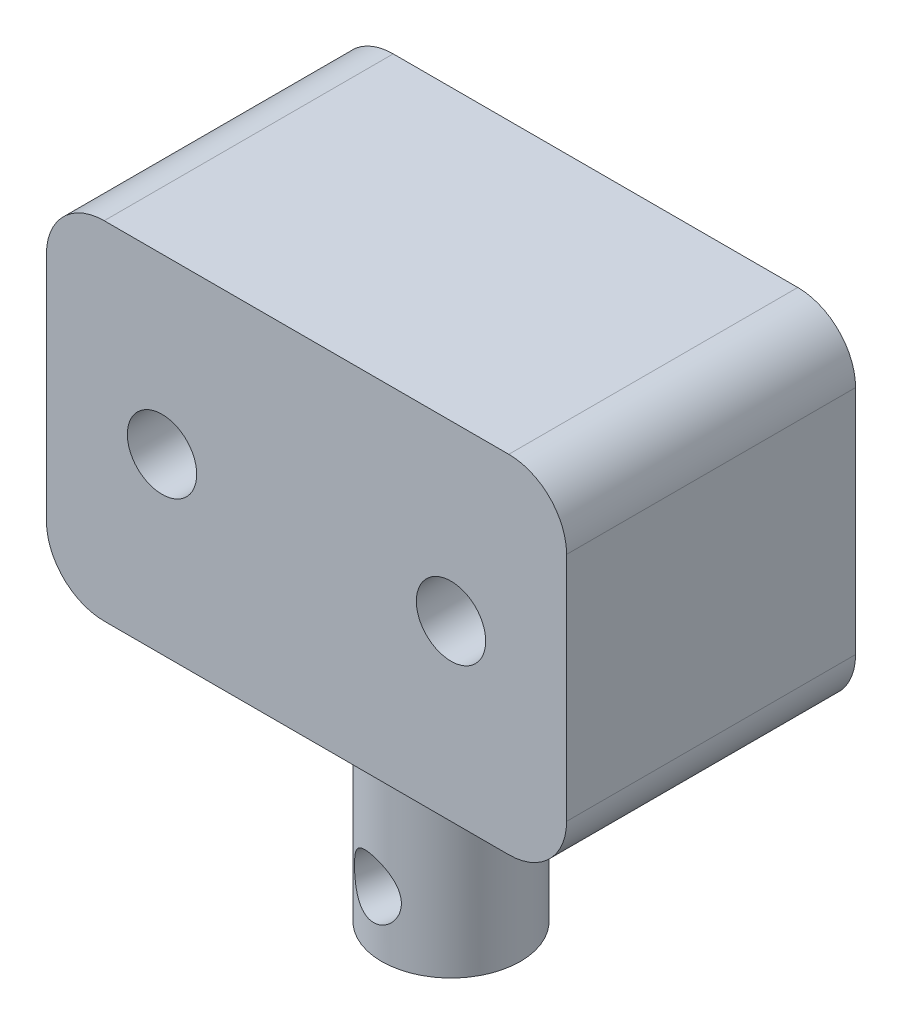
ISO-10303-21;
HEADER;
FILE_DESCRIPTION(('STEP AP214'),'2;1');
FILE_NAME('part.step','',(''),(''),'','','');
FILE_SCHEMA(('AUTOMOTIVE_DESIGN { 1 0 10303 214 1 1 1 1 }'));
ENDSEC;
DATA;
#1=APPLICATION_CONTEXT('core data for automotive mechanical design processes');
#2=APPLICATION_PROTOCOL_DEFINITION('international standard','automotive_design',2000,#1);
#3=PRODUCT_CONTEXT('',#1,'mechanical');
#4=PRODUCT('Part','Part','',(#3));
#5=PRODUCT_RELATED_PRODUCT_CATEGORY('part','',(#4));
#6=PRODUCT_DEFINITION_FORMATION('','',#4);
#7=PRODUCT_DEFINITION_CONTEXT('part definition',#1,'design');
#8=PRODUCT_DEFINITION('design','',#6,#7);
#9=PRODUCT_DEFINITION_SHAPE('','',#8);
#10=(LENGTH_UNIT() NAMED_UNIT(*) SI_UNIT(.MILLI.,.METRE.));
#11=(NAMED_UNIT(*) PLANE_ANGLE_UNIT() SI_UNIT($,.RADIAN.));
#12=(NAMED_UNIT(*) SI_UNIT($,.STERADIAN.) SOLID_ANGLE_UNIT());
#13=UNCERTAINTY_MEASURE_WITH_UNIT(LENGTH_MEASURE(1.E-05),#10,'distance_accuracy_value','');
#14=(GEOMETRIC_REPRESENTATION_CONTEXT(3) GLOBAL_UNCERTAINTY_ASSIGNED_CONTEXT((#13)) GLOBAL_UNIT_ASSIGNED_CONTEXT((#10,
#11,#12)) REPRESENTATION_CONTEXT('',''));
#15=CARTESIAN_POINT('',(0.,0.,0.));
#16=DIRECTION('',(0.,0.,1.));
#17=DIRECTION('',(1.,0.,0.));
#18=AXIS2_PLACEMENT_3D('',#15,#16,#17);
#19=CARTESIAN_POINT('',(-22.5,-15.,25.));
#20=DIRECTION('',(0.,1.,0.));
#21=DIRECTION('',(0.,0.,1.));
#22=AXIS2_PLACEMENT_3D('',#19,#20,#21);
#23=PLANE('',#22);
#24=DIRECTION('',(1.,0.,0.));
#25=VECTOR('',#24,1.);
#26=CARTESIAN_POINT('',(-22.5,-15.,0.));
#27=LINE('',#26,#25);
#28=CARTESIAN_POINT('',(-17.5,-15.,0.));
#29=VERTEX_POINT('',#28);
#30=CARTESIAN_POINT('',(17.5,-15.,0.));
#31=VERTEX_POINT('',#30);
#32=EDGE_CURVE('E139',#29,#31,#27,.T.);
#33=ORIENTED_EDGE('',*,*,#32,.T.);
#34=DIRECTION('',(0.,0.,-1.));
#35=VECTOR('',#34,1.);
#36=CARTESIAN_POINT('',(17.5,-15.,25.));
#37=LINE('',#36,#35);
#38=CARTESIAN_POINT('',(17.5,-15.,25.));
#39=VERTEX_POINT('',#38);
#40=EDGE_CURVE('E56',#31,#39,#37,.F.);
#41=ORIENTED_EDGE('',*,*,#40,.T.);
#42=DIRECTION('',(1.,0.,0.));
#43=VECTOR('',#42,1.);
#44=CARTESIAN_POINT('',(-22.5,-15.,25.));
#45=LINE('',#44,#43);
#46=CARTESIAN_POINT('',(-17.5,-15.,25.));
#47=VERTEX_POINT('',#46);
#48=EDGE_CURVE('E147',#47,#39,#45,.T.);
#49=ORIENTED_EDGE('',*,*,#48,.F.);
#50=DIRECTION('',(0.,0.,-1.));
#51=VECTOR('',#50,1.);
#52=CARTESIAN_POINT('',(-17.5,-15.,25.));
#53=LINE('',#52,#51);
#54=EDGE_CURVE('E163',#47,#29,#53,.T.);
#55=ORIENTED_EDGE('',*,*,#54,.T.);
#56=EDGE_LOOP('',(#33,#41,#49,#55));
#57=FACE_BOUND('',#56,.T.);
#58=CARTESIAN_POINT('',(0.,-15.,12.5));
#59=DIRECTION('',(0.,1.,0.));
#60=DIRECTION('',(0.,0.,1.));
#61=AXIS2_PLACEMENT_3D('',#58,#59,#60);
#62=CIRCLE('',#61,6.);
#63=CARTESIAN_POINT('',(0.,-15.,18.5));
#64=VERTEX_POINT('',#63);
#65=EDGE_CURVE('E11',#64,#64,#62,.F.);
#66=ORIENTED_EDGE('',*,*,#65,.F.);
#67=EDGE_LOOP('',(#66));
#68=FACE_BOUND('',#67,.T.);
#69=ADVANCED_FACE('F35',(#57,#68),#23,.F.);
#70=CARTESIAN_POINT('',(0.,0.,25.));
#71=DIRECTION('',(0.,0.,-1.));
#72=DIRECTION('',(-1.,0.,0.));
#73=AXIS2_PLACEMENT_3D('',#70,#71,#72);
#74=PLANE('',#73);
#75=CARTESIAN_POINT('',(-12.5,0.,25.));
#76=DIRECTION('',(0.,0.,1.));
#77=DIRECTION('',(1.,0.,0.));
#78=AXIS2_PLACEMENT_3D('',#75,#76,#77);
#79=CIRCLE('',#78,3.);
#80=CARTESIAN_POINT('',(-9.5,0.,25.));
#81=VERTEX_POINT('',#80);
#82=EDGE_CURVE('E141',#81,#81,#79,.T.);
#83=ORIENTED_EDGE('',*,*,#82,.F.);
#84=EDGE_LOOP('',(#83));
#85=FACE_BOUND('',#84,.T.);
#86=DIRECTION('',(0.,1.,0.));
#87=VECTOR('',#86,1.);
#88=CARTESIAN_POINT('',(22.5,-15.,25.));
#89=LINE('',#88,#87);
#90=CARTESIAN_POINT('',(22.5,-10.,25.));
#91=VERTEX_POINT('',#90);
#92=CARTESIAN_POINT('',(22.5,10.,25.));
#93=VERTEX_POINT('',#92);
#94=EDGE_CURVE('E146',#91,#93,#89,.T.);
#95=ORIENTED_EDGE('',*,*,#94,.T.);
#96=CARTESIAN_POINT('',(17.5,10.,25.));
#97=DIRECTION('',(0.,0.,-1.));
#98=DIRECTION('',(-1.,0.,0.));
#99=AXIS2_PLACEMENT_3D('',#96,#97,#98);
#100=CIRCLE('',#99,5.);
#101=CARTESIAN_POINT('',(17.5,15.,25.));
#102=VERTEX_POINT('',#101);
#103=EDGE_CURVE('E161',#93,#102,#100,.F.);
#104=ORIENTED_EDGE('',*,*,#103,.T.);
#105=DIRECTION('',(-1.,0.,0.));
#106=VECTOR('',#105,1.);
#107=CARTESIAN_POINT('',(-22.5,15.,25.));
#108=LINE('',#107,#106);
#109=CARTESIAN_POINT('',(-17.5,15.,25.));
#110=VERTEX_POINT('',#109);
#111=EDGE_CURVE('E128',#102,#110,#108,.T.);
#112=ORIENTED_EDGE('',*,*,#111,.T.);
#113=CARTESIAN_POINT('',(-17.5,10.,25.));
#114=DIRECTION('',(0.,0.,-1.));
#115=DIRECTION('',(-1.,0.,0.));
#116=AXIS2_PLACEMENT_3D('',#113,#114,#115);
#117=CIRCLE('',#116,5.);
#118=CARTESIAN_POINT('',(-22.5,10.,25.));
#119=VERTEX_POINT('',#118);
#120=EDGE_CURVE('E156',#110,#119,#117,.F.);
#121=ORIENTED_EDGE('',*,*,#120,.T.);
#122=DIRECTION('',(0.,-1.,0.));
#123=VECTOR('',#122,1.);
#124=CARTESIAN_POINT('',(-22.5,-15.,25.));
#125=LINE('',#124,#123);
#126=CARTESIAN_POINT('',(-22.5,-10.,25.));
#127=VERTEX_POINT('',#126);
#128=EDGE_CURVE('E234',#119,#127,#125,.T.);
#129=ORIENTED_EDGE('',*,*,#128,.T.);
#130=CARTESIAN_POINT('',(-17.5,-10.,25.));
#131=DIRECTION('',(0.,0.,-1.));
#132=DIRECTION('',(-1.,0.,0.));
#133=AXIS2_PLACEMENT_3D('',#130,#131,#132);
#134=CIRCLE('',#133,5.);
#135=EDGE_CURVE('E63',#127,#47,#134,.F.);
#136=ORIENTED_EDGE('',*,*,#135,.T.);
#137=ORIENTED_EDGE('',*,*,#48,.T.);
#138=CARTESIAN_POINT('',(17.5,-10.,25.));
#139=DIRECTION('',(0.,0.,-1.));
#140=DIRECTION('',(-1.,0.,0.));
#141=AXIS2_PLACEMENT_3D('',#138,#139,#140);
#142=CIRCLE('',#141,5.);
#143=EDGE_CURVE('E159',#39,#91,#142,.F.);
#144=ORIENTED_EDGE('',*,*,#143,.T.);
#145=EDGE_LOOP('',(#95,#104,#112,#121,#129,#136,#137,#144));
#146=FACE_BOUND('',#145,.T.);
#147=CARTESIAN_POINT('',(12.5,0.,25.));
#148=DIRECTION('',(0.,0.,1.));
#149=DIRECTION('',(-1.,0.,0.));
#150=AXIS2_PLACEMENT_3D('',#147,#148,#149);
#151=CIRCLE('',#150,3.);
#152=CARTESIAN_POINT('',(9.5,0.,25.));
#153=VERTEX_POINT('',#152);
#154=EDGE_CURVE('E243',#153,#153,#151,.T.);
#155=ORIENTED_EDGE('',*,*,#154,.F.);
#156=EDGE_LOOP('',(#155));
#157=FACE_BOUND('',#156,.T.);
#158=ADVANCED_FACE('F192',(#85,#146,#157),#74,.F.);
#159=CARTESIAN_POINT('',(0.,0.,0.));
#160=DIRECTION('',(0.,0.,-1.));
#161=DIRECTION('',(-1.,0.,0.));
#162=AXIS2_PLACEMENT_3D('',#159,#160,#161);
#163=PLANE('',#162);
#164=CARTESIAN_POINT('',(-12.5,0.,0.));
#165=DIRECTION('',(0.,0.,1.));
#166=DIRECTION('',(1.,0.,0.));
#167=AXIS2_PLACEMENT_3D('',#164,#165,#166);
#168=CIRCLE('',#167,3.);
#169=CARTESIAN_POINT('',(-9.5,0.,0.));
#170=VERTEX_POINT('',#169);
#171=EDGE_CURVE('E237',#170,#170,#168,.T.);
#172=ORIENTED_EDGE('',*,*,#171,.T.);
#173=EDGE_LOOP('',(#172));
#174=FACE_BOUND('',#173,.T.);
#175=DIRECTION('',(-1.,0.,0.));
#176=VECTOR('',#175,1.);
#177=CARTESIAN_POINT('',(-22.5,15.,0.));
#178=LINE('',#177,#176);
#179=CARTESIAN_POINT('',(17.5,15.,0.));
#180=VERTEX_POINT('',#179);
#181=CARTESIAN_POINT('',(-17.5,15.,0.));
#182=VERTEX_POINT('',#181);
#183=EDGE_CURVE('E125',#180,#182,#178,.T.);
#184=ORIENTED_EDGE('',*,*,#183,.F.);
#185=CARTESIAN_POINT('',(17.5,10.,0.));
#186=DIRECTION('',(0.,0.,-1.));
#187=DIRECTION('',(-1.,0.,0.));
#188=AXIS2_PLACEMENT_3D('',#185,#186,#187);
#189=CIRCLE('',#188,5.);
#190=CARTESIAN_POINT('',(22.5,10.,0.));
#191=VERTEX_POINT('',#190);
#192=EDGE_CURVE('E108',#180,#191,#189,.T.);
#193=ORIENTED_EDGE('',*,*,#192,.T.);
#194=DIRECTION('',(0.,1.,0.));
#195=VECTOR('',#194,1.);
#196=CARTESIAN_POINT('',(22.5,-15.,0.));
#197=LINE('',#196,#195);
#198=CARTESIAN_POINT('',(22.5,-10.,0.));
#199=VERTEX_POINT('',#198);
#200=EDGE_CURVE('E136',#199,#191,#197,.T.);
#201=ORIENTED_EDGE('',*,*,#200,.F.);
#202=CARTESIAN_POINT('',(17.5,-10.,0.));
#203=DIRECTION('',(0.,0.,-1.));
#204=DIRECTION('',(-1.,0.,0.));
#205=AXIS2_PLACEMENT_3D('',#202,#203,#204);
#206=CIRCLE('',#205,5.);
#207=EDGE_CURVE('E119',#199,#31,#206,.T.);
#208=ORIENTED_EDGE('',*,*,#207,.T.);
#209=ORIENTED_EDGE('',*,*,#32,.F.);
#210=CARTESIAN_POINT('',(-17.5,-10.,0.));
#211=DIRECTION('',(0.,0.,-1.));
#212=DIRECTION('',(-1.,0.,0.));
#213=AXIS2_PLACEMENT_3D('',#210,#211,#212);
#214=CIRCLE('',#213,5.);
#215=CARTESIAN_POINT('',(-22.5,-10.,0.));
#216=VERTEX_POINT('',#215);
#217=EDGE_CURVE('E150',#29,#216,#214,.T.);
#218=ORIENTED_EDGE('',*,*,#217,.T.);
#219=DIRECTION('',(0.,-1.,0.));
#220=VECTOR('',#219,1.);
#221=CARTESIAN_POINT('',(-22.5,-15.,0.));
#222=LINE('',#221,#220);
#223=CARTESIAN_POINT('',(-22.5,10.,0.));
#224=VERTEX_POINT('',#223);
#225=EDGE_CURVE('E135',#224,#216,#222,.T.);
#226=ORIENTED_EDGE('',*,*,#225,.F.);
#227=CARTESIAN_POINT('',(-17.5,10.,0.));
#228=DIRECTION('',(0.,0.,-1.));
#229=DIRECTION('',(-1.,0.,0.));
#230=AXIS2_PLACEMENT_3D('',#227,#228,#229);
#231=CIRCLE('',#230,5.);
#232=EDGE_CURVE('E129',#224,#182,#231,.T.);
#233=ORIENTED_EDGE('',*,*,#232,.T.);
#234=EDGE_LOOP('',(#184,#193,#201,#208,#209,#218,#226,#233));
#235=FACE_BOUND('',#234,.T.);
#236=CARTESIAN_POINT('',(12.5,0.,0.));
#237=DIRECTION('',(0.,0.,1.));
#238=DIRECTION('',(-1.,0.,0.));
#239=AXIS2_PLACEMENT_3D('',#236,#237,#238);
#240=CIRCLE('',#239,3.);
#241=CARTESIAN_POINT('',(9.5,0.,0.));
#242=VERTEX_POINT('',#241);
#243=EDGE_CURVE('E245',#242,#242,#240,.T.);
#244=ORIENTED_EDGE('',*,*,#243,.T.);
#245=EDGE_LOOP('',(#244));
#246=FACE_BOUND('',#245,.T.);
#247=ADVANCED_FACE('F132',(#174,#235,#246),#163,.T.);
#248=CARTESIAN_POINT('',(22.5,-15.,25.));
#249=DIRECTION('',(-1.,0.,0.));
#250=DIRECTION('',(0.,0.,1.));
#251=AXIS2_PLACEMENT_3D('',#248,#249,#250);
#252=PLANE('',#251);
#253=ORIENTED_EDGE('',*,*,#200,.T.);
#254=DIRECTION('',(0.,0.,-1.));
#255=VECTOR('',#254,1.);
#256=CARTESIAN_POINT('',(22.5,10.,25.));
#257=LINE('',#256,#255);
#258=EDGE_CURVE('E113',#191,#93,#257,.F.);
#259=ORIENTED_EDGE('',*,*,#258,.T.);
#260=ORIENTED_EDGE('',*,*,#94,.F.);
#261=DIRECTION('',(0.,0.,-1.));
#262=VECTOR('',#261,1.);
#263=CARTESIAN_POINT('',(22.5,-10.,25.));
#264=LINE('',#263,#262);
#265=EDGE_CURVE('E118',#91,#199,#264,.T.);
#266=ORIENTED_EDGE('',*,*,#265,.T.);
#267=EDGE_LOOP('',(#253,#259,#260,#266));
#268=FACE_BOUND('',#267,.T.);
#269=ADVANCED_FACE('F209',(#268),#252,.F.);
#270=CARTESIAN_POINT('',(-22.5,15.,25.));
#271=DIRECTION('',(0.,-1.,0.));
#272=DIRECTION('',(0.,0.,-1.));
#273=AXIS2_PLACEMENT_3D('',#270,#271,#272);
#274=PLANE('',#273);
#275=ORIENTED_EDGE('',*,*,#111,.F.);
#276=DIRECTION('',(0.,0.,-1.));
#277=VECTOR('',#276,1.);
#278=CARTESIAN_POINT('',(17.5,15.,25.));
#279=LINE('',#278,#277);
#280=EDGE_CURVE('E112',#102,#180,#279,.T.);
#281=ORIENTED_EDGE('',*,*,#280,.T.);
#282=ORIENTED_EDGE('',*,*,#183,.T.);
#283=DIRECTION('',(0.,0.,-1.));
#284=VECTOR('',#283,1.);
#285=CARTESIAN_POINT('',(-17.5,15.,25.));
#286=LINE('',#285,#284);
#287=EDGE_CURVE('E130',#182,#110,#286,.F.);
#288=ORIENTED_EDGE('',*,*,#287,.T.);
#289=EDGE_LOOP('',(#275,#281,#282,#288));
#290=FACE_BOUND('',#289,.T.);
#291=ADVANCED_FACE('F124',(#290),#274,.F.);
#292=CARTESIAN_POINT('',(-22.5,-15.,25.));
#293=DIRECTION('',(1.,0.,0.));
#294=DIRECTION('',(0.,0.,-1.));
#295=AXIS2_PLACEMENT_3D('',#292,#293,#294);
#296=PLANE('',#295);
#297=ORIENTED_EDGE('',*,*,#225,.T.);
#298=DIRECTION('',(0.,0.,-1.));
#299=VECTOR('',#298,1.);
#300=CARTESIAN_POINT('',(-22.5,-10.,25.));
#301=LINE('',#300,#299);
#302=EDGE_CURVE('E48',#216,#127,#301,.F.);
#303=ORIENTED_EDGE('',*,*,#302,.T.);
#304=ORIENTED_EDGE('',*,*,#128,.F.);
#305=DIRECTION('',(0.,0.,-1.));
#306=VECTOR('',#305,1.);
#307=CARTESIAN_POINT('',(-22.5,10.,25.));
#308=LINE('',#307,#306);
#309=EDGE_CURVE('E167',#119,#224,#308,.T.);
#310=ORIENTED_EDGE('',*,*,#309,.T.);
#311=EDGE_LOOP('',(#297,#303,#304,#310));
#312=FACE_BOUND('',#311,.T.);
#313=ADVANCED_FACE('F202',(#312),#296,.F.);
#314=CARTESIAN_POINT('',(-12.5,0.,25.));
#315=DIRECTION('',(0.,0.,-1.));
#316=DIRECTION('',(-1.,0.,0.));
#317=AXIS2_PLACEMENT_3D('',#314,#315,#316);
#318=CYLINDRICAL_SURFACE('',#317,3.);
#319=ORIENTED_EDGE('',*,*,#82,.T.);
#320=EDGE_LOOP('',(#319));
#321=FACE_BOUND('',#320,.T.);
#322=ORIENTED_EDGE('',*,*,#171,.F.);
#323=EDGE_LOOP('',(#322));
#324=FACE_BOUND('',#323,.T.);
#325=ADVANCED_FACE('F205',(#321,#324),#318,.F.);
#326=CARTESIAN_POINT('',(12.5,0.,25.));
#327=DIRECTION('',(0.,0.,-1.));
#328=DIRECTION('',(-1.,0.,0.));
#329=AXIS2_PLACEMENT_3D('',#326,#327,#328);
#330=CYLINDRICAL_SURFACE('',#329,3.);
#331=ORIENTED_EDGE('',*,*,#154,.T.);
#332=EDGE_LOOP('',(#331));
#333=FACE_BOUND('',#332,.T.);
#334=ORIENTED_EDGE('',*,*,#243,.F.);
#335=EDGE_LOOP('',(#334));
#336=FACE_BOUND('',#335,.T.);
#337=ADVANCED_FACE('F216',(#333,#336),#330,.F.);
#338=CARTESIAN_POINT('',(17.5,10.,25.));
#339=DIRECTION('',(0.,0.,-1.));
#340=DIRECTION('',(-1.,0.,0.));
#341=AXIS2_PLACEMENT_3D('',#338,#339,#340);
#342=CYLINDRICAL_SURFACE('',#341,5.);
#343=ORIENTED_EDGE('',*,*,#103,.F.);
#344=ORIENTED_EDGE('',*,*,#258,.F.);
#345=ORIENTED_EDGE('',*,*,#192,.F.);
#346=ORIENTED_EDGE('',*,*,#280,.F.);
#347=EDGE_LOOP('',(#343,#344,#345,#346));
#348=FACE_BOUND('',#347,.T.);
#349=ADVANCED_FACE('F111',(#348),#342,.T.);
#350=CARTESIAN_POINT('',(17.5,-10.,25.));
#351=DIRECTION('',(0.,0.,-1.));
#352=DIRECTION('',(-1.,0.,0.));
#353=AXIS2_PLACEMENT_3D('',#350,#351,#352);
#354=CYLINDRICAL_SURFACE('',#353,5.);
#355=ORIENTED_EDGE('',*,*,#143,.F.);
#356=ORIENTED_EDGE('',*,*,#40,.F.);
#357=ORIENTED_EDGE('',*,*,#207,.F.);
#358=ORIENTED_EDGE('',*,*,#265,.F.);
#359=EDGE_LOOP('',(#355,#356,#357,#358));
#360=FACE_BOUND('',#359,.T.);
#361=ADVANCED_FACE('F215',(#360),#354,.T.);
#362=CARTESIAN_POINT('',(-17.5,-10.,25.));
#363=DIRECTION('',(0.,0.,-1.));
#364=DIRECTION('',(-1.,0.,0.));
#365=AXIS2_PLACEMENT_3D('',#362,#363,#364);
#366=CYLINDRICAL_SURFACE('',#365,5.);
#367=ORIENTED_EDGE('',*,*,#135,.F.);
#368=ORIENTED_EDGE('',*,*,#302,.F.);
#369=ORIENTED_EDGE('',*,*,#217,.F.);
#370=ORIENTED_EDGE('',*,*,#54,.F.);
#371=EDGE_LOOP('',(#367,#368,#369,#370));
#372=FACE_BOUND('',#371,.T.);
#373=ADVANCED_FACE('F218',(#372),#366,.T.);
#374=CARTESIAN_POINT('',(-17.5,10.,25.));
#375=DIRECTION('',(0.,0.,-1.));
#376=DIRECTION('',(-1.,0.,0.));
#377=AXIS2_PLACEMENT_3D('',#374,#375,#376);
#378=CYLINDRICAL_SURFACE('',#377,5.);
#379=ORIENTED_EDGE('',*,*,#120,.F.);
#380=ORIENTED_EDGE('',*,*,#287,.F.);
#381=ORIENTED_EDGE('',*,*,#232,.F.);
#382=ORIENTED_EDGE('',*,*,#309,.F.);
#383=EDGE_LOOP('',(#379,#380,#381,#382));
#384=FACE_BOUND('',#383,.T.);
#385=ADVANCED_FACE('F37',(#384),#378,.T.);
#386=CARTESIAN_POINT('',(0.,-35.,12.5));
#387=DIRECTION('',(0.,1.,0.));
#388=DIRECTION('',(0.,0.,1.));
#389=AXIS2_PLACEMENT_3D('',#386,#387,#388);
#390=CYLINDRICAL_SURFACE('',#389,6.);
#391=CARTESIAN_POINT('',(0.,-32.2725464074792,18.5));
#392=CARTESIAN_POINT('',(-0.120500938892851,-32.326947661744,18.4999961471478));
#393=CARTESIAN_POINT('',(-0.245280092435085,-32.3722930044478,18.4963395154788));
#394=CARTESIAN_POINT('',(-0.49999510570674,-32.4431836275926,18.4804949975387));
#395=CARTESIAN_POINT('',(-0.629938742536067,-32.4686977577087,18.4682937465231));
#396=CARTESIAN_POINT('',(-0.891240270829619,-32.4988322073912,18.4348997068997));
#397=CARTESIAN_POINT('',(-1.02259924722839,-32.5034351566636,18.4136994590699));
#398=CARTESIAN_POINT('',(-1.28261680579114,-32.4914895616083,18.3628016744062));
#399=CARTESIAN_POINT('',(-1.41127642695698,-32.4749493131084,18.3331074738404));
#400=CARTESIAN_POINT('',(-1.6600071271347,-32.4219271024415,18.2672038323123));
#401=CARTESIAN_POINT('',(-1.78019243174133,-32.3858163662926,18.2311238433509));
#402=CARTESIAN_POINT('',(-2.01170765498819,-32.2952044471064,18.1540197106468));
#403=CARTESIAN_POINT('',(-2.12303512631191,-32.2406982032571,18.1129942083363));
#404=CARTESIAN_POINT('',(-2.33950147942695,-32.1120514155417,18.0263861525003));
#405=CARTESIAN_POINT('',(-2.44412428096296,-32.0371267438423,17.9806809859166));
#406=CARTESIAN_POINT('',(-2.63950406416588,-31.8709191267144,17.8893108662952));
#407=CARTESIAN_POINT('',(-2.73025468125894,-31.779628714151,17.8436459412161));
#408=CARTESIAN_POINT('',(-2.90207120020699,-31.5759565850104,17.7524357326108));
#409=CARTESIAN_POINT('',(-2.98205807815792,-31.4625624589421,17.7071099785713));
#410=CARTESIAN_POINT('',(-3.12287765255371,-31.2219413298452,17.623899639517));
#411=CARTESIAN_POINT('',(-3.18371046663184,-31.094714411776,17.5860150088036));
#412=CARTESIAN_POINT('',(-3.2842213310044,-30.8305241782192,17.5216977929824));
#413=CARTESIAN_POINT('',(-3.32405265305839,-30.6936399121276,17.495182506266));
#414=CARTESIAN_POINT('',(-3.38178041737154,-30.4134219939165,17.4562898857894));
#415=CARTESIAN_POINT('',(-3.3996948880348,-30.2700937432661,17.4439009325349));
#416=CARTESIAN_POINT('',(-3.41231689967468,-29.9939904902456,17.4351930955723));
#417=CARTESIAN_POINT('',(-3.40883881513462,-29.8613346059165,17.4376177010163));
#418=CARTESIAN_POINT('',(-3.3830058017045,-29.5987632564351,17.4553518582521));
#419=CARTESIAN_POINT('',(-3.36065068609324,-29.4688478184028,17.4706615374961));
#420=CARTESIAN_POINT('',(-3.29862059885859,-29.2185236996357,17.5120288822142));
#421=CARTESIAN_POINT('',(-3.25938187997436,-29.0979603422265,17.5378149704484));
#422=CARTESIAN_POINT('',(-3.16474432593624,-28.8655998577722,17.5977956419124));
#423=CARTESIAN_POINT('',(-3.10934055193199,-28.7538054231288,17.6319927944419));
#424=CARTESIAN_POINT('',(-2.97883591953366,-28.5332551299101,17.7089034131951));
#425=CARTESIAN_POINT('',(-2.90258051250884,-28.4253369179505,17.7520599298274));
#426=CARTESIAN_POINT('',(-2.73411767310447,-28.2243001652574,17.8416945302823));
#427=CARTESIAN_POINT('',(-2.6419034708344,-28.1311879376762,17.8881740188139));
#428=CARTESIAN_POINT('',(-2.43712715572727,-27.9568515509674,17.9839687222856));
#429=CARTESIAN_POINT('',(-2.32368229666276,-27.8766607222227,18.0332885413939));
#430=CARTESIAN_POINT('',(-2.08293471232099,-27.7378046969689,18.1283299145684));
#431=CARTESIAN_POINT('',(-1.95563615272877,-27.6791330528943,18.1740525431923));
#432=CARTESIAN_POINT('',(-1.69528376946506,-27.5873215885951,18.2570808496132));
#433=CARTESIAN_POINT('',(-1.56261344359229,-27.5533226192346,18.294634121563));
#434=CARTESIAN_POINT('',(-1.29130319826929,-27.5089341314869,18.3610580432447));
#435=CARTESIAN_POINT('',(-1.15266631464875,-27.4985327478578,18.3899330502071));
#436=CARTESIAN_POINT('',(-0.883549849593789,-27.501691212907,18.4360516067457));
#437=CARTESIAN_POINT('',(-0.753161486534729,-27.5136596163563,18.4539560499794));
#438=CARTESIAN_POINT('',(-0.494978343072741,-27.5579686128602,18.4809568934459));
#439=CARTESIAN_POINT('',(-0.367183579492926,-27.5903093380142,18.4900532365638));
#440=CARTESIAN_POINT('',(-0.117953704798394,-27.6740600595723,18.5001361612826));
#441=CARTESIAN_POINT('',(0.00349166888127983,-27.7254381254248,18.5011362585725));
#442=CARTESIAN_POINT('',(0.237272930253672,-27.8456297476167,18.4964481824595));
#443=CARTESIAN_POINT('',(0.349606157441586,-27.9144483721203,18.4907580631514));
#444=CARTESIAN_POINT('',(0.56961511850896,-28.0727836702989,18.4739852210933));
#445=CARTESIAN_POINT('',(0.676501921836539,-28.1633619778697,18.4625732329023));
#446=CARTESIAN_POINT('',(0.874389060330345,-28.3601723937085,18.4367854549821));
#447=CARTESIAN_POINT('',(0.965381876911067,-28.4664118668463,18.4224082695533));
#448=CARTESIAN_POINT('',(1.13286706155147,-28.6977949657396,18.3927247745858));
#449=CARTESIAN_POINT('',(1.20844083013482,-28.8236060161532,18.3774072470385));
#450=CARTESIAN_POINT('',(1.33628256195162,-29.0868593433502,18.3496717939799));
#451=CARTESIAN_POINT('',(1.38856251609247,-29.2242955923995,18.3372523781855));
#452=CARTESIAN_POINT('',(1.4653294405999,-29.5000040699924,18.3184459156769));
#453=CARTESIAN_POINT('',(1.49103317200564,-29.6379175741008,18.31179725997));
#454=CARTESIAN_POINT('',(1.5175323991338,-29.9162487725176,18.3049377883405));
#455=CARTESIAN_POINT('',(1.51834124330507,-30.0566650844229,18.3047235223487));
#456=CARTESIAN_POINT('',(1.49594448925625,-30.3245250177502,18.3105288236762));
#457=CARTESIAN_POINT('',(1.47457451750816,-30.4521381363673,18.3160719117714));
#458=CARTESIAN_POINT('',(1.41164587160525,-30.7019709700919,18.3316631411644));
#459=CARTESIAN_POINT('',(1.37008541490215,-30.8241902079528,18.3417116802269));
#460=CARTESIAN_POINT('',(1.26740309821339,-31.0628338328476,18.3648529238916));
#461=CARTESIAN_POINT('',(1.20588847179429,-31.1790824421259,18.3780051694714));
#462=CARTESIAN_POINT('',(1.06561044999216,-31.4006649148512,18.4050459058445));
#463=CARTESIAN_POINT('',(0.986831013740227,-31.5059884927928,18.4189350721603));
#464=CARTESIAN_POINT('',(0.806785046976896,-31.7121169905803,18.4462660084458));
#465=CARTESIAN_POINT('',(0.704171073126553,-31.8117638871069,18.4595677752127));
#466=CARTESIAN_POINT('',(0.484071071276242,-31.9932634820752,18.481457345128));
#467=CARTESIAN_POINT('',(0.366619259163912,-32.075155977973,18.4900557584531));
#468=CARTESIAN_POINT('',(0.203949147026316,-32.1700367005035,18.4966635222886));
#469=CARTESIAN_POINT('',(0.163924557363127,-32.1920113904848,18.4978974940758));
#470=CARTESIAN_POINT('',(0.0827704037359875,-32.2338669098646,18.4995664711871));
#471=CARTESIAN_POINT('',(0.0416406404616986,-32.253747358357,18.5000013314023));
#472=CARTESIAN_POINT('',(0.,-32.2725464074792,18.5));
#473=B_SPLINE_CURVE_WITH_KNOTS('',3,(#391,#392,#393,#394,#395,#396,#397,#398,#399,#400,#401,
#402,#403,#404,#405,#406,#407,#408,#409,#410,#411,#412,#413,#414,#415,#416,#417,#418,#419,#420,
#421,#422,#423,#424,#425,#426,#427,#428,#429,#430,#431,#432,#433,#434,#435,#436,#437,#438,#439,
#440,#441,#442,#443,#444,#445,#446,#447,#448,#449,#450,#451,#452,#453,#454,#455,#456,#457,#458,
#459,#460,#461,#462,#463,#464,#465,#466,#467,#468,#469,#470,#471,#472),.UNSPECIFIED.,.T.,.F.,(4,
2,2,2,2,2,2,2,2,2,2,2,2,2,2,2,2,2,2,2,2,2,2,2,2,2,2,2,2,2,2,2,2,2,2,2,2,2,2,2,4),(0.,
0.396469185922593,0.793559883247696,1.19098037172908,1.58824497460706,1.97822506736106,
2.3683125356183,2.77624500302225,3.18436407215436,3.62025065880839,4.05613456844475,
4.48879169514318,4.92109268613135,5.31726446437946,5.71344016138647,6.09994187863769,
6.48656180622593,6.90180356301271,7.31722190348916,7.7572915723297,8.19722927983248,
8.62099732080362,9.04455223718645,9.43911418908478,9.83367869945062,10.227584396674,
10.6216046930054,11.0414724906946,11.4615383703852,11.902000668091,12.3422359672578,
12.7612790454884,13.1800974320967,13.5668191464416,13.9535750093191,14.3484593694108,
14.7437121869233,15.1727895725041,15.6008949788434,15.7378751048482,15.8748801022933),.UNSPECIFIED.);
#474=CARTESIAN_POINT('',(0.,-32.2725464074792,18.5));
#475=VERTEX_POINT('',#474);
#476=EDGE_CURVE('E39',#475,#475,#473,.T.);
#477=ORIENTED_EDGE('',*,*,#476,.T.);
#478=EDGE_LOOP('',(#477));
#479=FACE_BOUND('',#478,.T.);
#480=CARTESIAN_POINT('',(-1.51488039283071,-30.,6.69438742289695));
#481=CARTESIAN_POINT('',(-1.51487869304488,-30.0667081831549,6.69438641959546));
#482=CARTESIAN_POINT('',(-1.51203205631701,-30.1334347921685,6.69364132079235));
#483=CARTESIAN_POINT('',(-1.5006887385673,-30.266386478403,6.69070056587829));
#484=CARTESIAN_POINT('',(-1.49218869974761,-30.3326112338951,6.6885040477122));
#485=CARTESIAN_POINT('',(-1.45829146022785,-30.5300518667706,6.67986450125283));
#486=CARTESIAN_POINT('',(-1.42449750889602,-30.6598368164295,6.67137192699848));
#487=CARTESIAN_POINT('',(-1.3363545026971,-30.9111547641313,6.65054190608663));
#488=CARTESIAN_POINT('',(-1.28208924541933,-31.0327190520916,6.63822016954389));
#489=CARTESIAN_POINT('',(-1.15510023444963,-31.265510176557,6.61188164084084));
#490=CARTESIAN_POINT('',(-1.08238084726175,-31.3767394499768,6.5978652500695));
#491=CARTESIAN_POINT('',(-0.916081875509981,-31.5926539820894,6.56971460987044));
#492=CARTESIAN_POINT('',(-0.821556731762853,-31.6966157970475,6.55561834060178));
#493=CARTESIAN_POINT('',(-0.61689334520075,-31.8883997651745,6.53090771721122));
#494=CARTESIAN_POINT('',(-0.506749111435026,-31.9762156955112,6.52029470434925));
#495=CARTESIAN_POINT('',(-0.268546837000141,-32.1368992555286,6.50477565663062));
#496=CARTESIAN_POINT('',(-0.139919017168177,-32.2089533078815,6.50013712291766));
#497=CARTESIAN_POINT('',(0.127586051382312,-32.3305519892175,6.49986921308015));
#498=CARTESIAN_POINT('',(0.266458718356183,-32.3801066103974,6.50423583290254));
#499=CARTESIAN_POINT('',(0.542589814505394,-32.4526789303404,6.52306625890348));
#500=CARTESIAN_POINT('',(0.6795561682347,-32.4769433932332,6.53699278958786));
#501=CARTESIAN_POINT('',(0.954247855234375,-32.502275278892,6.5747489512513));
#502=CARTESIAN_POINT('',(1.09197285796161,-32.5033521108742,6.59857456132173));
#503=CARTESIAN_POINT('',(1.35538694985893,-32.4829314389708,6.65363852374487));
#504=CARTESIAN_POINT('',(1.48129842415989,-32.4628037991731,6.68433749784825));
#505=CARTESIAN_POINT('',(1.72646408312293,-32.4028937944991,6.75234724659005));
#506=CARTESIAN_POINT('',(1.84571777628901,-32.3631099806788,6.78965850851952));
#507=CARTESIAN_POINT('',(2.07655807743865,-32.2645439182725,6.86945281416848));
#508=CARTESIAN_POINT('',(2.18799995120064,-32.2054810742758,6.9120060779166));
#509=CARTESIAN_POINT('',(2.39905546232855,-32.0703084865819,6.99930948037402));
#510=CARTESIAN_POINT('',(2.49866490036674,-31.9941927183022,7.04406039111081));
#511=CARTESIAN_POINT('',(2.69098464675873,-31.8208351591992,7.1361618505553));
#512=CARTESIAN_POINT('',(2.78271372297077,-31.722482417457,7.18347329309329));
#513=CARTESIAN_POINT('',(2.94915887457618,-31.5105771185719,7.27396361496291));
#514=CARTESIAN_POINT('',(3.02386838556109,-31.3970187233643,7.31714089604814));
#515=CARTESIAN_POINT('',(3.15688548349277,-31.1532099267203,7.39702957756174));
#516=CARTESIAN_POINT('',(3.21457330568963,-31.0225335886945,7.43348183144897));
#517=CARTESIAN_POINT('',(3.30842920533594,-30.7510379102374,7.49425734064114));
#518=CARTESIAN_POINT('',(3.34461267032979,-30.6102259035158,7.51858926668124));
#519=CARTESIAN_POINT('',(3.39250889167629,-30.332206382133,7.55109372963165));
#520=CARTESIAN_POINT('',(3.4056570117174,-30.1953577554715,7.56021227461519));
#521=CARTESIAN_POINT('',(3.41143305922508,-29.9210430351874,7.56419746667958));
#522=CARTESIAN_POINT('',(3.40406808590636,-29.7835771716193,7.55906904438257));
#523=CARTESIAN_POINT('',(3.37026741379017,-29.5212032291366,7.53596329605413));
#524=CARTESIAN_POINT('',(3.3450828619267,-29.3960546264258,7.51882961195649));
#525=CARTESIAN_POINT('',(3.27783790392326,-29.1522974070048,7.4743267027493));
#526=CARTESIAN_POINT('',(3.23577355319136,-29.0336903263384,7.44695508526798));
#527=CARTESIAN_POINT('',(3.13371469352839,-28.8007693792872,7.38300930220233));
#528=CARTESIAN_POINT('',(3.07303628997979,-28.6868500507806,7.34609450234098));
#529=CARTESIAN_POINT('',(2.93575826653615,-28.4711838950007,7.26668315618263));
#530=CARTESIAN_POINT('',(2.85915175532156,-28.3694423665913,7.2241841968296));
#531=CARTESIAN_POINT('',(2.68443457595317,-28.1723997302374,7.13303857291512));
#532=CARTESIAN_POINT('',(2.58508098560283,-28.0782972001197,7.08417308800343));
#533=CARTESIAN_POINT('',(2.37102856986097,-27.9090554160204,6.98710429348369));
#534=CARTESIAN_POINT('',(2.25632862081027,-27.8339175517941,6.93890103264888));
#535=CARTESIAN_POINT('',(2.01362298496338,-27.7048202491916,6.84648736990586));
#536=CARTESIAN_POINT('',(1.88558398852909,-27.6509155177152,6.80228750517038));
#537=CARTESIAN_POINT('',(1.61981818087974,-27.5667664150372,6.72112085390637));
#538=CARTESIAN_POINT('',(1.48209718864911,-27.536507962451,6.6841497724809));
#539=CARTESIAN_POINT('',(1.21114024624412,-27.5022837499796,6.62198128860438));
#540=CARTESIAN_POINT('',(1.07826367748419,-27.4966280042899,6.59614155614192));
#541=CARTESIAN_POINT('',(0.811932236095345,-27.5072262789047,6.55366184580961));
#542=CARTESIAN_POINT('',(0.678477468934594,-27.523476458314,6.5370202558965));
#543=CARTESIAN_POINT('',(0.419776751242356,-27.5762121575427,6.51334135086665));
#544=CARTESIAN_POINT('',(0.294407540670934,-27.6119594094758,6.50598427945193));
#545=CARTESIAN_POINT('',(0.0502474967188561,-27.7018684458724,6.49896620369831));
#546=CARTESIAN_POINT('',(-0.0685420820456801,-27.7560337283582,6.49930666210853));
#547=CARTESIAN_POINT('',(-0.301859095539788,-27.8839792475792,6.50641010427416));
#548=CARTESIAN_POINT('',(-0.415951286205572,-27.9585353235131,6.51346264939618));
#549=CARTESIAN_POINT('',(-0.631147121269927,-28.1240136448107,6.53230860338262));
#550=CARTESIAN_POINT('',(-0.732245919933073,-28.2149419658361,6.54410377422315));
#551=CARTESIAN_POINT('',(-0.92538716385359,-28.4178925300721,6.57093536623966));
#552=CARTESIAN_POINT('',(-1.01634523828078,-28.53092911203,6.58613772747238));
#553=CARTESIAN_POINT('',(-1.17784387854926,-28.7709063920007,6.61617037363201));
#554=CARTESIAN_POINT('',(-1.24837303002104,-28.8978548086674,6.6310004463381));
#555=CARTESIAN_POINT('',(-1.36581749583547,-29.1619289333595,6.65721030203025));
#556=CARTESIAN_POINT('',(-1.41285832178647,-29.2989959551496,6.66860829184106));
#557=CARTESIAN_POINT('',(-1.46425313094995,-29.5091637690664,6.68138772689053));
#558=CARTESIAN_POINT('',(-1.47818610468353,-29.5799105979561,6.68492660989698));
#559=CARTESIAN_POINT('',(-1.49953507993057,-29.7224260564186,6.69039375843669));
#560=CARTESIAN_POINT('',(-1.50695568367604,-29.7941939279226,6.69232316132697));
#561=CARTESIAN_POINT('',(-1.51360821247909,-29.910711605639,6.69405543103549));
#562=CARTESIAN_POINT('',(-1.51488153051106,-29.9553516756734,6.69438809441472));
#563=CARTESIAN_POINT('',(-1.51488039283071,-30.,6.69438742289695));
#564=B_SPLINE_CURVE_WITH_KNOTS('',3,(#480,#481,#482,#483,#484,#485,#486,#487,#488,#489,#490,
#491,#492,#493,#494,#495,#496,#497,#498,#499,#500,#501,#502,#503,#504,#505,#506,#507,#508,#509,
#510,#511,#512,#513,#514,#515,#516,#517,#518,#519,#520,#521,#522,#523,#524,#525,#526,#527,#528,
#529,#530,#531,#532,#533,#534,#535,#536,#537,#538,#539,#540,#541,#542,#543,#544,#545,#546,#547,
#548,#549,#550,#551,#552,#553,#554,#555,#556,#557,#558,#559,#560,#561,#562,#563),.UNSPECIFIED.,
.T.,.F.,(4,2,2,2,2,2,2,2,2,2,2,2,2,2,2,2,2,2,2,2,2,2,2,2,2,2,2,2,2,2,2,2,2,2,2,2,2,2,2,2,2,4),
(0.,0.200084575093045,0.400288095243579,0.801278994956904,1.20064597557677,1.59991854837275,
2.02172149988563,2.44368668047076,2.88395420283104,3.32402600677038,3.7411967908316,
4.15819828963116,4.54982147617441,4.94147353531023,5.33910096407387,5.73686909172223,
6.16267530816224,6.58864548009989,7.02861558463919,7.46827048625635,7.87940023747112,
8.29038772171394,8.6750626926688,9.05982760961556,9.46088720770835,9.86212068725427,
10.2960179260552,10.7299469521823,11.1649867904569,11.5997673642051,12.004157373226,
12.4084764873833,12.7984529720747,13.1885035639884,13.5961819279257,14.0040118923231,
14.4395932095167,14.8754174341574,15.3088871873109,15.5252058174741,15.7413714538654,
15.8752896716763),.UNSPECIFIED.);
#565=CARTESIAN_POINT('',(-1.51488039283071,-30.,6.69438742289695));
#566=VERTEX_POINT('',#565);
#567=EDGE_CURVE('E170',#566,#566,#564,.T.);
#568=ORIENTED_EDGE('',*,*,#567,.T.);
#569=EDGE_LOOP('',(#568));
#570=FACE_BOUND('',#569,.T.);
#571=CARTESIAN_POINT('',(0.,-35.,12.5));
#572=DIRECTION('',(0.,-1.,0.));
#573=DIRECTION('',(0.,0.,-1.));
#574=AXIS2_PLACEMENT_3D('',#571,#572,#573);
#575=CIRCLE('',#574,6.);
#576=CARTESIAN_POINT('',(0.,-35.,6.5));
#577=VERTEX_POINT('',#576);
#578=EDGE_CURVE('E249',#577,#577,#575,.T.);
#579=ORIENTED_EDGE('',*,*,#578,.F.);
#580=EDGE_LOOP('',(#579));
#581=FACE_BOUND('',#580,.T.);
#582=ORIENTED_EDGE('',*,*,#65,.T.);
#583=EDGE_LOOP('',(#582));
#584=FACE_BOUND('',#583,.T.);
#585=ADVANCED_FACE('F174',(#479,#570,#581,#584),#390,.T.);
#586=CARTESIAN_POINT('',(0.,-35.,12.5));
#587=DIRECTION('',(0.,-1.,0.));
#588=DIRECTION('',(0.,0.,-1.));
#589=AXIS2_PLACEMENT_3D('',#586,#587,#588);
#590=PLANE('',#589);
#591=ORIENTED_EDGE('',*,*,#578,.T.);
#592=EDGE_LOOP('',(#591));
#593=FACE_BOUND('',#592,.T.);
#594=ADVANCED_FACE('F181',(#593),#590,.T.);
#595=CARTESIAN_POINT('',(-2.81608391194391,-30.,28.4708054923256));
#596=DIRECTION('',(0.173648177666927,0.,-0.984807753012209));
#597=DIRECTION('',(-0.984807753012209,0.,-0.173648177666927));
#598=AXIS2_PLACEMENT_3D('',#595,#596,#597);
#599=CYLINDRICAL_SURFACE('',#598,2.5);
#600=ORIENTED_EDGE('',*,*,#567,.F.);
#601=EDGE_LOOP('',(#600));
#602=FACE_BOUND('',#601,.T.);
#603=ORIENTED_EDGE('',*,*,#476,.F.);
#604=EDGE_LOOP('',(#603));
#605=FACE_BOUND('',#604,.T.);
#606=ADVANCED_FACE('F178',(#602,#605),#599,.F.);
#607=CLOSED_SHELL('',(#69,#158,#247,#269,#291,#313,#325,#337,#349,#361,#373,#385,#585,#594,#606));
#608=MANIFOLD_SOLID_BREP('B2',#607);
#609=ADVANCED_BREP_SHAPE_REPRESENTATION('',(#18,#608),#14);
#610=SHAPE_DEFINITION_REPRESENTATION(#9,#609);
ENDSEC;
END-ISO-10303-21;
